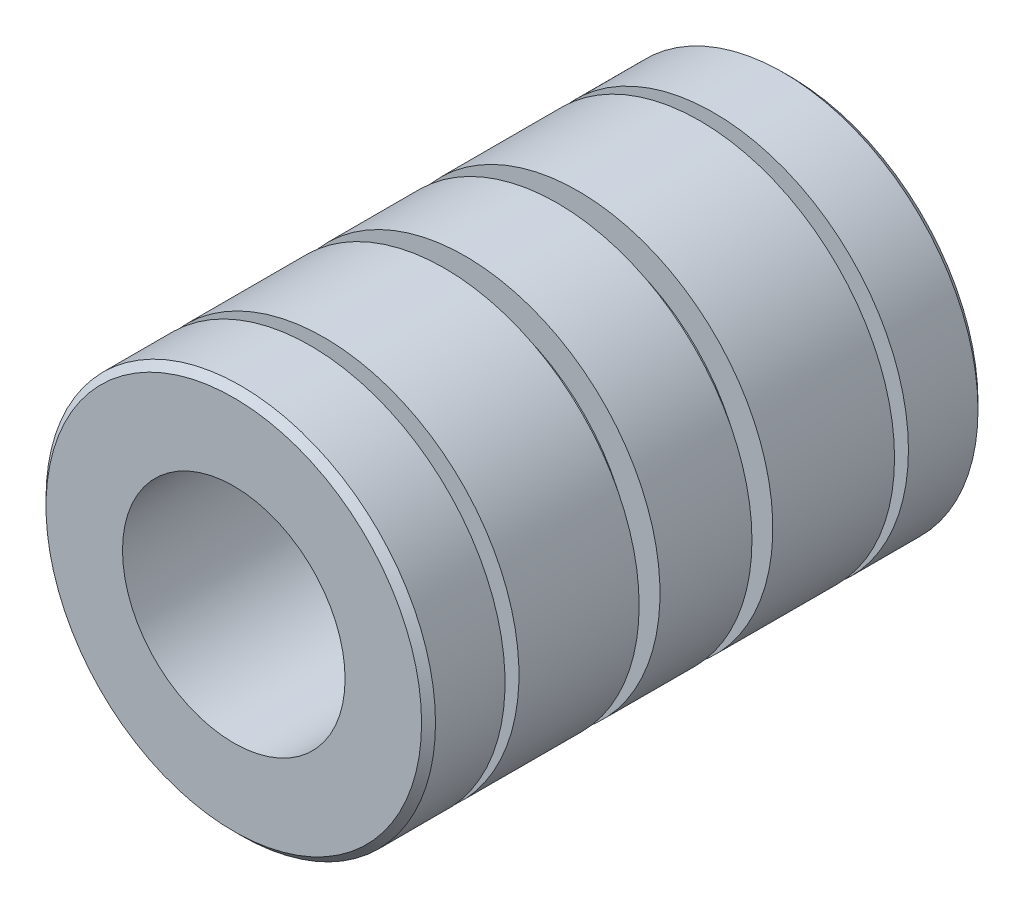
ISO-10303-21;
HEADER;
FILE_DESCRIPTION(('STEP AP214'),'2;1');
FILE_NAME('part.step','',(''),(''),'','','');
FILE_SCHEMA(('AUTOMOTIVE_DESIGN { 1 0 10303 214 1 1 1 1 }'));
ENDSEC;
DATA;
#1=APPLICATION_CONTEXT('core data for automotive mechanical design processes');
#2=APPLICATION_PROTOCOL_DEFINITION('international standard','automotive_design',2000,#1);
#3=PRODUCT_CONTEXT('',#1,'mechanical');
#4=PRODUCT('Part','Part','',(#3));
#5=PRODUCT_RELATED_PRODUCT_CATEGORY('part','',(#4));
#6=PRODUCT_DEFINITION_FORMATION('','',#4);
#7=PRODUCT_DEFINITION_CONTEXT('part definition',#1,'design');
#8=PRODUCT_DEFINITION('design','',#6,#7);
#9=PRODUCT_DEFINITION_SHAPE('','',#8);
#10=(LENGTH_UNIT() NAMED_UNIT(*) SI_UNIT(.MILLI.,.METRE.));
#11=(NAMED_UNIT(*) PLANE_ANGLE_UNIT() SI_UNIT($,.RADIAN.));
#12=(NAMED_UNIT(*) SI_UNIT($,.STERADIAN.) SOLID_ANGLE_UNIT());
#13=UNCERTAINTY_MEASURE_WITH_UNIT(LENGTH_MEASURE(1.E-05),#10,'distance_accuracy_value','');
#14=(GEOMETRIC_REPRESENTATION_CONTEXT(3) GLOBAL_UNCERTAINTY_ASSIGNED_CONTEXT((#13)) GLOBAL_UNIT_ASSIGNED_CONTEXT((#10,
#11,#12)) REPRESENTATION_CONTEXT('',''));
#15=CARTESIAN_POINT('',(0.,0.,0.));
#16=DIRECTION('',(0.,0.,1.));
#17=DIRECTION('',(1.,0.,0.));
#18=AXIS2_PLACEMENT_3D('',#15,#16,#17);
#19=CARTESIAN_POINT('',(0.,0.,31.75));
#20=DIRECTION('',(0.,0.,-1.));
#21=DIRECTION('',(-1.,0.,0.));
#22=AXIS2_PLACEMENT_3D('',#19,#20,#21);
#23=CYLINDRICAL_SURFACE('',#22,11.1125);
#24=CARTESIAN_POINT('',(0.,0.,19.7330901235873));
#25=DIRECTION('',(0.,0.,1.));
#26=DIRECTION('',(1.,0.,0.));
#27=AXIS2_PLACEMENT_3D('',#24,#25,#26);
#28=CIRCLE('',#27,11.1125);
#29=CARTESIAN_POINT('',(11.1125,0.,19.7330901235873));
#30=VERTEX_POINT('',#29);
#31=EDGE_CURVE('E52',#30,#30,#28,.T.);
#32=ORIENTED_EDGE('',*,*,#31,.T.);
#33=EDGE_LOOP('',(#32));
#34=FACE_BOUND('',#33,.T.);
#35=CARTESIAN_POINT('',(0.,0.,26.590625));
#36=DIRECTION('',(0.,0.,-1.));
#37=DIRECTION('',(-1.,0.,0.));
#38=AXIS2_PLACEMENT_3D('',#35,#36,#37);
#39=CIRCLE('',#38,11.1125);
#40=CARTESIAN_POINT('',(-11.1125,0.,26.590625));
#41=VERTEX_POINT('',#40);
#42=EDGE_CURVE('E104',#41,#41,#39,.T.);
#43=ORIENTED_EDGE('',*,*,#42,.T.);
#44=EDGE_LOOP('',(#43));
#45=FACE_BOUND('',#44,.T.);
#46=ADVANCED_FACE('F48',(#34,#45),#23,.T.);
#47=CARTESIAN_POINT('',(0.,0.,12.1046875));
#48=DIRECTION('',(0.,0.,-1.));
#49=DIRECTION('',(-1.,0.,0.));
#50=AXIS2_PLACEMENT_3D('',#47,#48,#49);
#51=CIRCLE('',#50,11.1125);
#52=CARTESIAN_POINT('',(-11.1125,0.,12.1046875));
#53=VERTEX_POINT('',#52);
#54=EDGE_CURVE('E68',#53,#53,#51,.T.);
#55=ORIENTED_EDGE('',*,*,#54,.T.);
#56=EDGE_LOOP('',(#55));
#57=FACE_BOUND('',#56,.T.);
#58=CARTESIAN_POINT('',(0.,0.,5.15937499999999));
#59=DIRECTION('',(0.,0.,1.));
#60=DIRECTION('',(1.,0.,0.));
#61=AXIS2_PLACEMENT_3D('',#58,#59,#60);
#62=CIRCLE('',#61,11.1125);
#63=CARTESIAN_POINT('',(11.1125,0.,5.15937499999999));
#64=VERTEX_POINT('',#63);
#65=EDGE_CURVE('E101',#64,#64,#62,.T.);
#66=ORIENTED_EDGE('',*,*,#65,.T.);
#67=EDGE_LOOP('',(#66));
#68=FACE_BOUND('',#67,.T.);
#69=ADVANCED_FACE('F138',(#57,#68),#23,.T.);
#70=CARTESIAN_POINT('',(0.,0.,0.396874999999991));
#71=DIRECTION('',(0.,0.,1.));
#72=DIRECTION('',(1.,0.,0.));
#73=AXIS2_PLACEMENT_3D('',#70,#71,#72);
#74=CIRCLE('',#73,11.1125);
#75=CARTESIAN_POINT('',(11.1125,0.,0.396874999999991));
#76=VERTEX_POINT('',#75);
#77=EDGE_CURVE('E108',#76,#76,#74,.T.);
#78=ORIENTED_EDGE('',*,*,#77,.T.);
#79=EDGE_LOOP('',(#78));
#80=FACE_BOUND('',#79,.T.);
#81=CARTESIAN_POINT('',(0.,0.,4.36562500000001));
#82=DIRECTION('',(0.,0.,1.));
#83=DIRECTION('',(1.,0.,0.));
#84=AXIS2_PLACEMENT_3D('',#81,#82,#83);
#85=CIRCLE('',#84,11.1125);
#86=CARTESIAN_POINT('',(11.1125,0.,4.36562500000001));
#87=VERTEX_POINT('',#86);
#88=EDGE_CURVE('E96',#87,#87,#85,.T.);
#89=ORIENTED_EDGE('',*,*,#88,.F.);
#90=EDGE_LOOP('',(#89));
#91=FACE_BOUND('',#90,.T.);
#92=ADVANCED_FACE('F134',(#80,#91),#23,.T.);
#93=CARTESIAN_POINT('',(0.,0.,31.353125));
#94=DIRECTION('',(0.,0.,1.));
#95=DIRECTION('',(1.,0.,0.));
#96=AXIS2_PLACEMENT_3D('',#93,#94,#95);
#97=CIRCLE('',#96,11.1125);
#98=CARTESIAN_POINT('',(11.1125,0.,31.353125));
#99=VERTEX_POINT('',#98);
#100=EDGE_CURVE('E12',#99,#99,#97,.F.);
#101=ORIENTED_EDGE('',*,*,#100,.T.);
#102=EDGE_LOOP('',(#101));
#103=FACE_BOUND('',#102,.T.);
#104=CARTESIAN_POINT('',(0.,0.,27.384375));
#105=DIRECTION('',(0.,0.,-1.));
#106=DIRECTION('',(-1.,0.,0.));
#107=AXIS2_PLACEMENT_3D('',#104,#105,#106);
#108=CIRCLE('',#107,11.1125);
#109=CARTESIAN_POINT('',(-11.1125,0.,27.384375));
#110=VERTEX_POINT('',#109);
#111=EDGE_CURVE('E112',#110,#110,#108,.T.);
#112=ORIENTED_EDGE('',*,*,#111,.F.);
#113=EDGE_LOOP('',(#112));
#114=FACE_BOUND('',#113,.T.);
#115=ADVANCED_FACE('F137',(#103,#114),#23,.T.);
#116=CARTESIAN_POINT('',(0.,0.,18.5424651235873));
#117=DIRECTION('',(0.,0.,-1.));
#118=DIRECTION('',(-1.,0.,0.));
#119=AXIS2_PLACEMENT_3D('',#116,#117,#118);
#120=CIRCLE('',#119,11.1125);
#121=CARTESIAN_POINT('',(-11.1125,0.,18.5424651235873));
#122=VERTEX_POINT('',#121);
#123=EDGE_CURVE('E72',#122,#122,#120,.T.);
#124=ORIENTED_EDGE('',*,*,#123,.T.);
#125=EDGE_LOOP('',(#124));
#126=FACE_BOUND('',#125,.T.);
#127=CARTESIAN_POINT('',(0.,0.,13.2953125));
#128=DIRECTION('',(0.,0.,1.));
#129=DIRECTION('',(1.,0.,0.));
#130=AXIS2_PLACEMENT_3D('',#127,#128,#129);
#131=CIRCLE('',#130,11.1125);
#132=CARTESIAN_POINT('',(11.1125,0.,13.2953125));
#133=VERTEX_POINT('',#132);
#134=EDGE_CURVE('E65',#133,#133,#131,.T.);
#135=ORIENTED_EDGE('',*,*,#134,.T.);
#136=EDGE_LOOP('',(#135));
#137=FACE_BOUND('',#136,.T.);
#138=ADVANCED_FACE('F160',(#126,#137),#23,.T.);
#139=CARTESIAN_POINT('',(0.,0.,31.75));
#140=DIRECTION('',(0.,0.,1.));
#141=DIRECTION('',(1.,0.,0.));
#142=AXIS2_PLACEMENT_3D('',#139,#140,#141);
#143=PLANE('',#142);
#144=CARTESIAN_POINT('',(0.,0.,31.75));
#145=DIRECTION('',(0.,0.,1.));
#146=DIRECTION('',(1.,0.,0.));
#147=AXIS2_PLACEMENT_3D('',#144,#145,#146);
#148=CIRCLE('',#147,10.715625);
#149=CARTESIAN_POINT('',(10.715625,0.,31.75));
#150=VERTEX_POINT('',#149);
#151=EDGE_CURVE('E56',#150,#150,#148,.T.);
#152=ORIENTED_EDGE('',*,*,#151,.T.);
#153=EDGE_LOOP('',(#152));
#154=FACE_BOUND('',#153,.T.);
#155=CARTESIAN_POINT('',(0.,0.,31.75));
#156=DIRECTION('',(0.,0.,1.));
#157=DIRECTION('',(1.,0.,0.));
#158=AXIS2_PLACEMENT_3D('',#155,#156,#157);
#159=CIRCLE('',#158,6.35);
#160=CARTESIAN_POINT('',(6.35,0.,31.75));
#161=VERTEX_POINT('',#160);
#162=EDGE_CURVE('E109',#161,#161,#159,.T.);
#163=ORIENTED_EDGE('',*,*,#162,.F.);
#164=EDGE_LOOP('',(#163));
#165=FACE_BOUND('',#164,.T.);
#166=ADVANCED_FACE('F168',(#154,#165),#143,.T.);
#167=CARTESIAN_POINT('',(0.,0.,0.));
#168=DIRECTION('',(0.,0.,1.));
#169=DIRECTION('',(1.,0.,0.));
#170=AXIS2_PLACEMENT_3D('',#167,#168,#169);
#171=PLANE('',#170);
#172=CARTESIAN_POINT('',(0.,0.,0.));
#173=DIRECTION('',(0.,0.,1.));
#174=DIRECTION('',(1.,0.,0.));
#175=AXIS2_PLACEMENT_3D('',#172,#173,#174);
#176=CIRCLE('',#175,10.715625);
#177=CARTESIAN_POINT('',(10.715625,0.,0.));
#178=VERTEX_POINT('',#177);
#179=EDGE_CURVE('E61',#178,#178,#176,.F.);
#180=ORIENTED_EDGE('',*,*,#179,.T.);
#181=EDGE_LOOP('',(#180));
#182=FACE_BOUND('',#181,.T.);
#183=CARTESIAN_POINT('',(0.,0.,0.));
#184=DIRECTION('',(0.,0.,1.));
#185=DIRECTION('',(1.,0.,0.));
#186=AXIS2_PLACEMENT_3D('',#183,#184,#185);
#187=CIRCLE('',#186,6.35);
#188=CARTESIAN_POINT('',(6.35,0.,0.));
#189=VERTEX_POINT('',#188);
#190=EDGE_CURVE('E105',#189,#189,#187,.T.);
#191=ORIENTED_EDGE('',*,*,#190,.T.);
#192=EDGE_LOOP('',(#191));
#193=FACE_BOUND('',#192,.T.);
#194=ADVANCED_FACE('F125',(#182,#193),#171,.F.);
#195=CARTESIAN_POINT('',(0.,0.,0.));
#196=DIRECTION('',(0.,0.,1.));
#197=DIRECTION('',(1.,0.,0.));
#198=AXIS2_PLACEMENT_3D('',#195,#196,#197);
#199=CYLINDRICAL_SURFACE('',#198,6.35);
#200=ORIENTED_EDGE('',*,*,#190,.F.);
#201=EDGE_LOOP('',(#200));
#202=FACE_BOUND('',#201,.T.);
#203=ORIENTED_EDGE('',*,*,#162,.T.);
#204=EDGE_LOOP('',(#203));
#205=FACE_BOUND('',#204,.T.);
#206=ADVANCED_FACE('F297',(#202,#205),#199,.F.);
#207=CARTESIAN_POINT('',(12.7,0.,27.384375));
#208=DIRECTION('',(0.,0.,-1.));
#209=DIRECTION('',(-1.,0.,0.));
#210=AXIS2_PLACEMENT_3D('',#207,#208,#209);
#211=PLANE('',#210);
#212=CARTESIAN_POINT('',(0.,0.,27.384375));
#213=DIRECTION('',(0.,0.,1.));
#214=DIRECTION('',(1.,0.,0.));
#215=AXIS2_PLACEMENT_3D('',#212,#213,#214);
#216=CIRCLE('',#215,9.52499999999999);
#217=CARTESIAN_POINT('',(9.52499999999999,0.,27.384375));
#218=VERTEX_POINT('',#217);
#219=EDGE_CURVE('E100',#218,#218,#216,.T.);
#220=ORIENTED_EDGE('',*,*,#219,.T.);
#221=EDGE_LOOP('',(#220));
#222=FACE_BOUND('',#221,.T.);
#223=ORIENTED_EDGE('',*,*,#111,.T.);
#224=EDGE_LOOP('',(#223));
#225=FACE_BOUND('',#224,.T.);
#226=ADVANCED_FACE('F289',(#222,#225),#211,.T.);
#227=CARTESIAN_POINT('',(12.7,0.,26.590625));
#228=DIRECTION('',(0.,0.,-1.));
#229=DIRECTION('',(-1.,0.,0.));
#230=AXIS2_PLACEMENT_3D('',#227,#228,#229);
#231=PLANE('',#230);
#232=CARTESIAN_POINT('',(0.,0.,26.590625));
#233=DIRECTION('',(0.,0.,1.));
#234=DIRECTION('',(1.,0.,0.));
#235=AXIS2_PLACEMENT_3D('',#232,#233,#234);
#236=CIRCLE('',#235,9.52499999999999);
#237=CARTESIAN_POINT('',(9.52499999999999,0.,26.590625));
#238=VERTEX_POINT('',#237);
#239=EDGE_CURVE('E97',#238,#238,#236,.T.);
#240=ORIENTED_EDGE('',*,*,#239,.F.);
#241=EDGE_LOOP('',(#240));
#242=FACE_BOUND('',#241,.T.);
#243=ORIENTED_EDGE('',*,*,#42,.F.);
#244=EDGE_LOOP('',(#243));
#245=FACE_BOUND('',#244,.T.);
#246=ADVANCED_FACE('F280',(#242,#245),#231,.F.);
#247=CARTESIAN_POINT('',(0.,0.,31.75));
#248=DIRECTION('',(0.,0.,1.));
#249=DIRECTION('',(1.,0.,0.));
#250=AXIS2_PLACEMENT_3D('',#247,#248,#249);
#251=CYLINDRICAL_SURFACE('',#250,9.52499999999999);
#252=ORIENTED_EDGE('',*,*,#219,.F.);
#253=EDGE_LOOP('',(#252));
#254=FACE_BOUND('',#253,.T.);
#255=ORIENTED_EDGE('',*,*,#239,.T.);
#256=EDGE_LOOP('',(#255));
#257=FACE_BOUND('',#256,.T.);
#258=ADVANCED_FACE('F153',(#254,#257),#251,.T.);
#259=CARTESIAN_POINT('',(9.52499999999999,0.,5.15937499999999));
#260=DIRECTION('',(0.,0.,1.));
#261=DIRECTION('',(1.,0.,0.));
#262=AXIS2_PLACEMENT_3D('',#259,#260,#261);
#263=PLANE('',#262);
#264=CARTESIAN_POINT('',(0.,0.,5.15937499999999));
#265=DIRECTION('',(0.,0.,1.));
#266=DIRECTION('',(1.,0.,0.));
#267=AXIS2_PLACEMENT_3D('',#264,#265,#266);
#268=CIRCLE('',#267,9.525);
#269=CARTESIAN_POINT('',(9.525,0.,5.15937499999999));
#270=VERTEX_POINT('',#269);
#271=EDGE_CURVE('E71',#270,#270,#268,.T.);
#272=ORIENTED_EDGE('',*,*,#271,.T.);
#273=EDGE_LOOP('',(#272));
#274=FACE_BOUND('',#273,.T.);
#275=ORIENTED_EDGE('',*,*,#65,.F.);
#276=EDGE_LOOP('',(#275));
#277=FACE_BOUND('',#276,.T.);
#278=ADVANCED_FACE('F144',(#274,#277),#263,.F.);
#279=CARTESIAN_POINT('',(9.52499999999999,0.,4.36562500000001));
#280=DIRECTION('',(0.,0.,1.));
#281=DIRECTION('',(1.,0.,0.));
#282=AXIS2_PLACEMENT_3D('',#279,#280,#281);
#283=PLANE('',#282);
#284=CARTESIAN_POINT('',(0.,0.,4.36562500000001));
#285=DIRECTION('',(0.,0.,1.));
#286=DIRECTION('',(1.,0.,0.));
#287=AXIS2_PLACEMENT_3D('',#284,#285,#286);
#288=CIRCLE('',#287,9.525);
#289=CARTESIAN_POINT('',(9.525,0.,4.36562500000001));
#290=VERTEX_POINT('',#289);
#291=EDGE_CURVE('E93',#290,#290,#288,.T.);
#292=ORIENTED_EDGE('',*,*,#291,.F.);
#293=EDGE_LOOP('',(#292));
#294=FACE_BOUND('',#293,.T.);
#295=ORIENTED_EDGE('',*,*,#88,.T.);
#296=EDGE_LOOP('',(#295));
#297=FACE_BOUND('',#296,.T.);
#298=ADVANCED_FACE('F142',(#294,#297),#283,.T.);
#299=CARTESIAN_POINT('',(0.,0.,31.75));
#300=DIRECTION('',(0.,0.,1.));
#301=DIRECTION('',(1.,0.,0.));
#302=AXIS2_PLACEMENT_3D('',#299,#300,#301);
#303=CYLINDRICAL_SURFACE('',#302,9.525);
#304=ORIENTED_EDGE('',*,*,#271,.F.);
#305=EDGE_LOOP('',(#304));
#306=FACE_BOUND('',#305,.T.);
#307=ORIENTED_EDGE('',*,*,#291,.T.);
#308=EDGE_LOOP('',(#307));
#309=FACE_BOUND('',#308,.T.);
#310=ADVANCED_FACE('F131',(#306,#309),#303,.T.);
#311=CARTESIAN_POINT('',(0.,0.,0.396874999999991));
#312=DIRECTION('',(0.,0.,1.));
#313=DIRECTION('',(1.,0.,0.));
#314=AXIS2_PLACEMENT_3D('',#311,#312,#313);
#315=CONICAL_SURFACE('',#314,11.1125,0.785398163397455);
#316=ORIENTED_EDGE('',*,*,#179,.F.);
#317=EDGE_LOOP('',(#316));
#318=FACE_BOUND('',#317,.T.);
#319=ORIENTED_EDGE('',*,*,#77,.F.);
#320=EDGE_LOOP('',(#319));
#321=FACE_BOUND('',#320,.T.);
#322=ADVANCED_FACE('F128',(#318,#321),#315,.T.);
#323=CARTESIAN_POINT('',(0.,0.,31.75));
#324=DIRECTION('',(0.,0.,-1.));
#325=DIRECTION('',(-1.,0.,0.));
#326=AXIS2_PLACEMENT_3D('',#323,#324,#325);
#327=CONICAL_SURFACE('',#326,10.715625,0.785398163397442);
#328=ORIENTED_EDGE('',*,*,#100,.F.);
#329=EDGE_LOOP('',(#328));
#330=FACE_BOUND('',#329,.T.);
#331=ORIENTED_EDGE('',*,*,#151,.F.);
#332=EDGE_LOOP('',(#331));
#333=FACE_BOUND('',#332,.T.);
#334=ADVANCED_FACE('F50',(#330,#333),#327,.T.);
#335=CARTESIAN_POINT('',(9.52500000000001,0.,12.1046875));
#336=DIRECTION('',(0.,0.,-1.));
#337=DIRECTION('',(-1.,0.,0.));
#338=AXIS2_PLACEMENT_3D('',#335,#336,#337);
#339=PLANE('',#338);
#340=CARTESIAN_POINT('',(0.,0.,12.1046875));
#341=DIRECTION('',(0.,0.,1.));
#342=DIRECTION('',(1.,0.,0.));
#343=AXIS2_PLACEMENT_3D('',#340,#341,#342);
#344=CIRCLE('',#343,9.525);
#345=CARTESIAN_POINT('',(9.525,0.,12.1046875));
#346=VERTEX_POINT('',#345);
#347=EDGE_CURVE('E69',#346,#346,#344,.T.);
#348=ORIENTED_EDGE('',*,*,#347,.F.);
#349=EDGE_LOOP('',(#348));
#350=FACE_BOUND('',#349,.T.);
#351=ORIENTED_EDGE('',*,*,#54,.F.);
#352=EDGE_LOOP('',(#351));
#353=FACE_BOUND('',#352,.T.);
#354=ADVANCED_FACE('F181',(#350,#353),#339,.F.);
#355=CARTESIAN_POINT('',(9.52500000000001,0.,13.2953125));
#356=DIRECTION('',(0.,0.,1.));
#357=DIRECTION('',(1.,0.,0.));
#358=AXIS2_PLACEMENT_3D('',#355,#356,#357);
#359=PLANE('',#358);
#360=CARTESIAN_POINT('',(0.,0.,13.2953125));
#361=DIRECTION('',(0.,0.,1.));
#362=DIRECTION('',(1.,0.,0.));
#363=AXIS2_PLACEMENT_3D('',#360,#361,#362);
#364=CIRCLE('',#363,9.525);
#365=CARTESIAN_POINT('',(9.525,0.,13.2953125));
#366=VERTEX_POINT('',#365);
#367=EDGE_CURVE('E78',#366,#366,#364,.T.);
#368=ORIENTED_EDGE('',*,*,#367,.T.);
#369=EDGE_LOOP('',(#368));
#370=FACE_BOUND('',#369,.T.);
#371=ORIENTED_EDGE('',*,*,#134,.F.);
#372=EDGE_LOOP('',(#371));
#373=FACE_BOUND('',#372,.T.);
#374=ADVANCED_FACE('F178',(#370,#373),#359,.F.);
#375=CARTESIAN_POINT('',(0.,0.,31.353125));
#376=DIRECTION('',(0.,0.,1.));
#377=DIRECTION('',(1.,0.,0.));
#378=AXIS2_PLACEMENT_3D('',#375,#376,#377);
#379=CYLINDRICAL_SURFACE('',#378,9.525);
#380=ORIENTED_EDGE('',*,*,#367,.F.);
#381=EDGE_LOOP('',(#380));
#382=FACE_BOUND('',#381,.T.);
#383=ORIENTED_EDGE('',*,*,#347,.T.);
#384=EDGE_LOOP('',(#383));
#385=FACE_BOUND('',#384,.T.);
#386=ADVANCED_FACE('F180',(#382,#385),#379,.T.);
#387=CARTESIAN_POINT('',(9.52500000000001,0.,19.7330901235873));
#388=DIRECTION('',(0.,0.,1.));
#389=DIRECTION('',(1.,0.,0.));
#390=AXIS2_PLACEMENT_3D('',#387,#388,#389);
#391=PLANE('',#390);
#392=CARTESIAN_POINT('',(0.,0.,19.7330901235873));
#393=DIRECTION('',(0.,0.,1.));
#394=DIRECTION('',(1.,0.,0.));
#395=AXIS2_PLACEMENT_3D('',#392,#393,#394);
#396=CIRCLE('',#395,9.525);
#397=CARTESIAN_POINT('',(9.525,0.,19.7330901235873));
#398=VERTEX_POINT('',#397);
#399=EDGE_CURVE('E74',#398,#398,#396,.T.);
#400=ORIENTED_EDGE('',*,*,#399,.T.);
#401=EDGE_LOOP('',(#400));
#402=FACE_BOUND('',#401,.T.);
#403=ORIENTED_EDGE('',*,*,#31,.F.);
#404=EDGE_LOOP('',(#403));
#405=FACE_BOUND('',#404,.T.);
#406=ADVANCED_FACE('F188',(#402,#405),#391,.F.);
#407=CARTESIAN_POINT('',(9.52500000000001,0.,18.5424651235873));
#408=DIRECTION('',(0.,0.,-1.));
#409=DIRECTION('',(-1.,0.,0.));
#410=AXIS2_PLACEMENT_3D('',#407,#408,#409);
#411=PLANE('',#410);
#412=CARTESIAN_POINT('',(0.,0.,18.5424651235873));
#413=DIRECTION('',(0.,0.,1.));
#414=DIRECTION('',(1.,0.,0.));
#415=AXIS2_PLACEMENT_3D('',#412,#413,#414);
#416=CIRCLE('',#415,9.525);
#417=CARTESIAN_POINT('',(9.525,0.,18.5424651235873));
#418=VERTEX_POINT('',#417);
#419=EDGE_CURVE('E80',#418,#418,#416,.T.);
#420=ORIENTED_EDGE('',*,*,#419,.F.);
#421=EDGE_LOOP('',(#420));
#422=FACE_BOUND('',#421,.T.);
#423=ORIENTED_EDGE('',*,*,#123,.F.);
#424=EDGE_LOOP('',(#423));
#425=FACE_BOUND('',#424,.T.);
#426=ADVANCED_FACE('F196',(#422,#425),#411,.F.);
#427=CARTESIAN_POINT('',(0.,0.,31.353125));
#428=DIRECTION('',(0.,0.,1.));
#429=DIRECTION('',(1.,0.,0.));
#430=AXIS2_PLACEMENT_3D('',#427,#428,#429);
#431=CYLINDRICAL_SURFACE('',#430,9.525);
#432=ORIENTED_EDGE('',*,*,#399,.F.);
#433=EDGE_LOOP('',(#432));
#434=FACE_BOUND('',#433,.T.);
#435=ORIENTED_EDGE('',*,*,#419,.T.);
#436=EDGE_LOOP('',(#435));
#437=FACE_BOUND('',#436,.T.);
#438=ADVANCED_FACE('F197',(#434,#437),#431,.T.);
#439=CLOSED_SHELL('',(#46,#69,#92,#115,#138,#166,#194,#206,#226,#246,#258,#278,#298,#310,#322,
#334,#354,#374,#386,#406,#426,#438));
#440=MANIFOLD_SOLID_BREP('B2',#439);
#441=ADVANCED_BREP_SHAPE_REPRESENTATION('',(#18,#440),#14);
#442=SHAPE_DEFINITION_REPRESENTATION(#9,#441);
ENDSEC;
END-ISO-10303-21;
